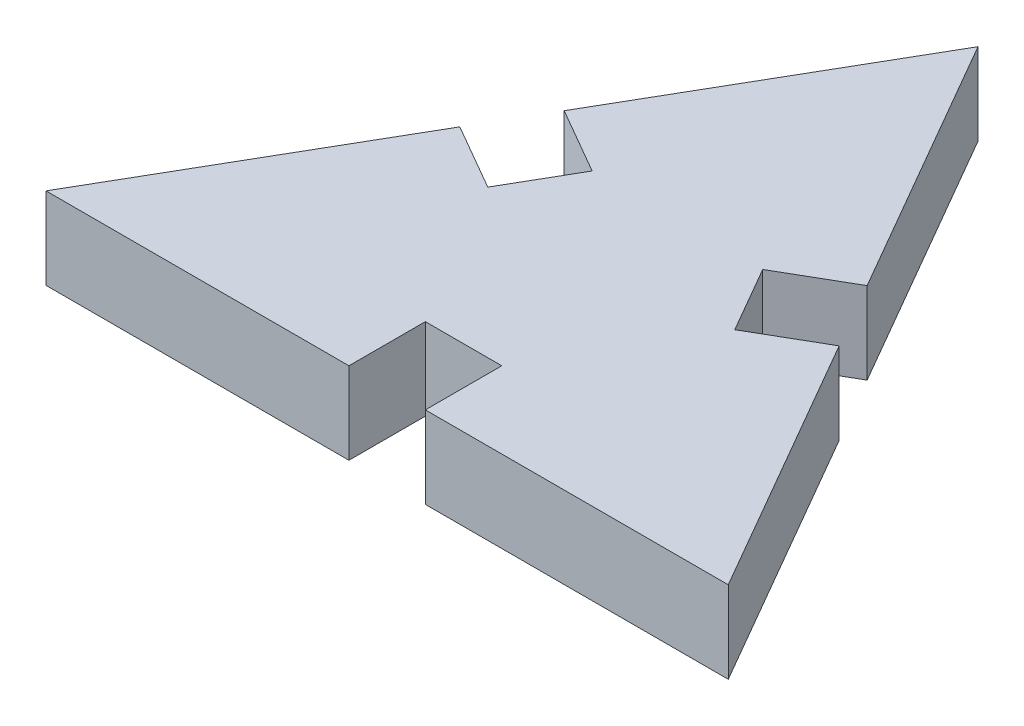
ISO-10303-21;
HEADER;
FILE_DESCRIPTION(('STEP AP214'),'2;1');
FILE_NAME('part.step','',(''),(''),'','','');
FILE_SCHEMA(('AUTOMOTIVE_DESIGN { 1 0 10303 214 1 1 1 1 }'));
ENDSEC;
DATA;
#1=APPLICATION_CONTEXT('core data for automotive mechanical design processes');
#2=APPLICATION_PROTOCOL_DEFINITION('international standard','automotive_design',2000,#1);
#3=PRODUCT_CONTEXT('',#1,'mechanical');
#4=PRODUCT('Part','Part','',(#3));
#5=PRODUCT_RELATED_PRODUCT_CATEGORY('part','',(#4));
#6=PRODUCT_DEFINITION_FORMATION('','',#4);
#7=PRODUCT_DEFINITION_CONTEXT('part definition',#1,'design');
#8=PRODUCT_DEFINITION('design','',#6,#7);
#9=PRODUCT_DEFINITION_SHAPE('','',#8);
#10=(LENGTH_UNIT() NAMED_UNIT(*) SI_UNIT(.MILLI.,.METRE.));
#11=(NAMED_UNIT(*) PLANE_ANGLE_UNIT() SI_UNIT($,.RADIAN.));
#12=(NAMED_UNIT(*) SI_UNIT($,.STERADIAN.) SOLID_ANGLE_UNIT());
#13=UNCERTAINTY_MEASURE_WITH_UNIT(LENGTH_MEASURE(1.E-05),#10,'distance_accuracy_value','');
#14=(GEOMETRIC_REPRESENTATION_CONTEXT(3) GLOBAL_UNCERTAINTY_ASSIGNED_CONTEXT((#13)) GLOBAL_UNIT_ASSIGNED_CONTEXT((#10,
#11,#12)) REPRESENTATION_CONTEXT('',''));
#15=CARTESIAN_POINT('',(0.,0.,0.));
#16=DIRECTION('',(0.,0.,1.));
#17=DIRECTION('',(1.,0.,0.));
#18=AXIS2_PLACEMENT_3D('',#15,#16,#17);
#19=CARTESIAN_POINT('',(12.5,3.,7.21687836487032));
#20=DIRECTION('',(-0.866025403784439,0.,0.5));
#21=DIRECTION('',(0.5,0.,0.866025403784439));
#22=AXIS2_PLACEMENT_3D('',#19,#20,#21);
#23=PLANE('',#22);
#24=DIRECTION('',(-0.5,0.,-0.866025403784439));
#25=VECTOR('',#24,1.);
#26=CARTESIAN_POINT('',(12.5,0.,7.21687836487032));
#27=LINE('',#26,#25);
#28=CARTESIAN_POINT('',(12.5,0.,7.21687836487032));
#29=VERTEX_POINT('',#28);
#30=CARTESIAN_POINT('',(6.95,0.,-2.39600361713695));
#31=VERTEX_POINT('',#30);
#32=EDGE_CURVE('E163',#29,#31,#27,.T.);
#33=ORIENTED_EDGE('',*,*,#32,.T.);
#34=DIRECTION('',(0.,1.,0.));
#35=VECTOR('',#34,1.);
#36=CARTESIAN_POINT('',(6.95,-0.00100000000000013,-2.39600361713695));
#37=LINE('',#36,#35);
#38=CARTESIAN_POINT('',(6.95,3.,-2.39600361713695));
#39=VERTEX_POINT('',#38);
#40=EDGE_CURVE('E150',#31,#39,#37,.T.);
#41=ORIENTED_EDGE('',*,*,#40,.T.);
#42=DIRECTION('',(-0.5,0.,-0.866025403784439));
#43=VECTOR('',#42,1.);
#44=CARTESIAN_POINT('',(12.5,3.,7.21687836487032));
#45=LINE('',#44,#43);
#46=CARTESIAN_POINT('',(12.5,3.,7.21687836487032));
#47=VERTEX_POINT('',#46);
#48=EDGE_CURVE('E240',#47,#39,#45,.T.);
#49=ORIENTED_EDGE('',*,*,#48,.F.);
#50=DIRECTION('',(0.,-1.,0.));
#51=VECTOR('',#50,1.);
#52=CARTESIAN_POINT('',(12.5,3.,7.21687836487032));
#53=LINE('',#52,#51);
#54=EDGE_CURVE('E176',#47,#29,#53,.T.);
#55=ORIENTED_EDGE('',*,*,#54,.T.);
#56=EDGE_LOOP('',(#33,#41,#49,#55));
#57=FACE_BOUND('',#56,.T.);
#58=ADVANCED_FACE('F34',(#57),#23,.F.);
#59=CARTESIAN_POINT('',(0.,3.,-14.4337567297406));
#60=DIRECTION('',(0.866025403784439,0.,0.5));
#61=DIRECTION('',(0.5,0.,-0.866025403784439));
#62=AXIS2_PLACEMENT_3D('',#59,#60,#61);
#63=PLANE('',#62);
#64=DIRECTION('',(-0.5,0.,0.866025403784439));
#65=VECTOR('',#64,1.);
#66=CARTESIAN_POINT('',(0.,0.,-14.4337567297406));
#67=LINE('',#66,#65);
#68=CARTESIAN_POINT('',(0.,0.,-14.4337567297406));
#69=VERTEX_POINT('',#68);
#70=CARTESIAN_POINT('',(-5.55000000000001,0.,-4.82087474773338));
#71=VERTEX_POINT('',#70);
#72=EDGE_CURVE('E162',#69,#71,#67,.T.);
#73=ORIENTED_EDGE('',*,*,#72,.T.);
#74=DIRECTION('',(0.,1.,0.));
#75=VECTOR('',#74,1.);
#76=CARTESIAN_POINT('',(-5.55000000000001,-0.00100000000000013,-4.82087474773338));
#77=LINE('',#76,#75);
#78=CARTESIAN_POINT('',(-5.55000000000001,3.,-4.82087474773338));
#79=VERTEX_POINT('',#78);
#80=EDGE_CURVE('E231',#71,#79,#77,.T.);
#81=ORIENTED_EDGE('',*,*,#80,.T.);
#82=DIRECTION('',(-0.5,0.,0.866025403784439));
#83=VECTOR('',#82,1.);
#84=CARTESIAN_POINT('',(0.,3.,-14.4337567297406));
#85=LINE('',#84,#83);
#86=CARTESIAN_POINT('',(0.,3.,-14.4337567297406));
#87=VERTEX_POINT('',#86);
#88=EDGE_CURVE('E243',#87,#79,#85,.T.);
#89=ORIENTED_EDGE('',*,*,#88,.F.);
#90=DIRECTION('',(0.,-1.,0.));
#91=VECTOR('',#90,1.);
#92=CARTESIAN_POINT('',(0.,3.,-14.4337567297406));
#93=LINE('',#92,#91);
#94=EDGE_CURVE('E11',#87,#69,#93,.T.);
#95=ORIENTED_EDGE('',*,*,#94,.T.);
#96=EDGE_LOOP('',(#73,#81,#89,#95));
#97=FACE_BOUND('',#96,.T.);
#98=ADVANCED_FACE('F265',(#97),#63,.F.);
#99=CARTESIAN_POINT('',(-12.5,3.,7.21687836487032));
#100=DIRECTION('',(0.,0.,-1.));
#101=DIRECTION('',(-1.,0.,0.));
#102=AXIS2_PLACEMENT_3D('',#99,#100,#101);
#103=PLANE('',#102);
#104=DIRECTION('',(1.,0.,0.));
#105=VECTOR('',#104,1.);
#106=CARTESIAN_POINT('',(-12.5,0.,7.21687836487032));
#107=LINE('',#106,#105);
#108=CARTESIAN_POINT('',(-12.5,0.,7.21687836487032));
#109=VERTEX_POINT('',#108);
#110=CARTESIAN_POINT('',(-1.39999999999999,0.,7.21687836487033));
#111=VERTEX_POINT('',#110);
#112=EDGE_CURVE('E173',#109,#111,#107,.T.);
#113=ORIENTED_EDGE('',*,*,#112,.T.);
#114=DIRECTION('',(0.,1.,0.));
#115=VECTOR('',#114,1.);
#116=CARTESIAN_POINT('',(-1.39999999999999,-0.00100000000000013,7.21687836487033));
#117=LINE('',#116,#115);
#118=CARTESIAN_POINT('',(-1.39999999999999,3.,7.21687836487033));
#119=VERTEX_POINT('',#118);
#120=EDGE_CURVE('E208',#111,#119,#117,.T.);
#121=ORIENTED_EDGE('',*,*,#120,.T.);
#122=DIRECTION('',(1.,0.,0.));
#123=VECTOR('',#122,1.);
#124=CARTESIAN_POINT('',(-12.5,3.,7.21687836487032));
#125=LINE('',#124,#123);
#126=CARTESIAN_POINT('',(-12.5,3.,7.21687836487032));
#127=VERTEX_POINT('',#126);
#128=EDGE_CURVE('E169',#127,#119,#125,.T.);
#129=ORIENTED_EDGE('',*,*,#128,.F.);
#130=DIRECTION('',(0.,-1.,0.));
#131=VECTOR('',#130,1.);
#132=CARTESIAN_POINT('',(-12.5,3.,7.21687836487032));
#133=LINE('',#132,#131);
#134=EDGE_CURVE('E42',#127,#109,#133,.T.);
#135=ORIENTED_EDGE('',*,*,#134,.T.);
#136=EDGE_LOOP('',(#113,#121,#129,#135));
#137=FACE_BOUND('',#136,.T.);
#138=ADVANCED_FACE('F183',(#137),#103,.F.);
#139=CARTESIAN_POINT('',(5.55,3.,-4.82087474773338));
#140=VERTEX_POINT('',#139);
#141=EDGE_CURVE('E156',#140,#87,#45,.T.);
#142=ORIENTED_EDGE('',*,*,#141,.F.);
#143=DIRECTION('',(0.,1.,0.));
#144=VECTOR('',#143,1.);
#145=CARTESIAN_POINT('',(5.55,-0.00100000000000013,-4.82087474773338));
#146=LINE('',#145,#144);
#147=CARTESIAN_POINT('',(5.55,0.,-4.82087474773338));
#148=VERTEX_POINT('',#147);
#149=EDGE_CURVE('E144',#148,#140,#146,.T.);
#150=ORIENTED_EDGE('',*,*,#149,.F.);
#151=EDGE_CURVE('E149',#148,#69,#27,.T.);
#152=ORIENTED_EDGE('',*,*,#151,.T.);
#153=ORIENTED_EDGE('',*,*,#94,.F.);
#154=EDGE_LOOP('',(#142,#150,#152,#153));
#155=FACE_BOUND('',#154,.T.);
#156=ADVANCED_FACE('F36',(#155),#23,.F.);
#157=CARTESIAN_POINT('',(-6.95000000000001,3.,-2.39600361713695));
#158=VERTEX_POINT('',#157);
#159=EDGE_CURVE('E242',#158,#127,#85,.T.);
#160=ORIENTED_EDGE('',*,*,#159,.F.);
#161=DIRECTION('',(0.,1.,0.));
#162=VECTOR('',#161,1.);
#163=CARTESIAN_POINT('',(-6.95000000000001,-0.00100000000000013,-2.39600361713695));
#164=LINE('',#163,#162);
#165=CARTESIAN_POINT('',(-6.95,0.,-2.39600361713695));
#166=VERTEX_POINT('',#165);
#167=EDGE_CURVE('E230',#166,#158,#164,.T.);
#168=ORIENTED_EDGE('',*,*,#167,.F.);
#169=EDGE_CURVE('E166',#166,#109,#67,.T.);
#170=ORIENTED_EDGE('',*,*,#169,.T.);
#171=ORIENTED_EDGE('',*,*,#134,.F.);
#172=EDGE_LOOP('',(#160,#168,#170,#171));
#173=FACE_BOUND('',#172,.T.);
#174=ADVANCED_FACE('F255',(#173),#63,.F.);
#175=CARTESIAN_POINT('',(1.40000000000001,3.,7.21687836487033));
#176=VERTEX_POINT('',#175);
#177=EDGE_CURVE('E245',#176,#47,#125,.T.);
#178=ORIENTED_EDGE('',*,*,#177,.F.);
#179=DIRECTION('',(0.,1.,0.));
#180=VECTOR('',#179,1.);
#181=CARTESIAN_POINT('',(1.40000000000001,-0.00100000000000013,7.21687836487033));
#182=LINE('',#181,#180);
#183=CARTESIAN_POINT('',(1.40000000000001,0.,7.21687836487032));
#184=VERTEX_POINT('',#183);
#185=EDGE_CURVE('E207',#184,#176,#182,.T.);
#186=ORIENTED_EDGE('',*,*,#185,.F.);
#187=EDGE_CURVE('E172',#184,#29,#107,.T.);
#188=ORIENTED_EDGE('',*,*,#187,.T.);
#189=ORIENTED_EDGE('',*,*,#54,.F.);
#190=EDGE_LOOP('',(#178,#186,#188,#189));
#191=FACE_BOUND('',#190,.T.);
#192=ADVANCED_FACE('F272',(#191),#103,.F.);
#193=CARTESIAN_POINT('',(0.,3.,0.));
#194=DIRECTION('',(0.,1.,0.));
#195=DIRECTION('',(0.,0.,1.));
#196=AXIS2_PLACEMENT_3D('',#193,#194,#195);
#197=PLANE('',#196);
#198=DIRECTION('',(0.866025403784439,0.,-0.5));
#199=VECTOR('',#198,1.);
#200=CARTESIAN_POINT('',(6.95,3.,-2.39600361713695));
#201=LINE('',#200,#199);
#202=CARTESIAN_POINT('',(4.52512886940358,3.,-0.996003617136954));
#203=VERTEX_POINT('',#202);
#204=EDGE_CURVE('E157',#203,#39,#201,.T.);
#205=ORIENTED_EDGE('',*,*,#204,.F.);
#206=DIRECTION('',(0.5,0.,0.866025403784438));
#207=VECTOR('',#206,1.);
#208=CARTESIAN_POINT('',(3.12512886940358,3.,-3.42087474773338));
#209=LINE('',#208,#207);
#210=CARTESIAN_POINT('',(3.12512886940358,3.,-3.42087474773338));
#211=VERTEX_POINT('',#210);
#212=EDGE_CURVE('E450',#211,#203,#209,.T.);
#213=ORIENTED_EDGE('',*,*,#212,.F.);
#214=DIRECTION('',(-0.866025403784438,0.,0.5));
#215=VECTOR('',#214,1.);
#216=CARTESIAN_POINT('',(5.55,3.,-4.82087474773338));
#217=LINE('',#216,#215);
#218=EDGE_CURVE('E452',#140,#211,#217,.T.);
#219=ORIENTED_EDGE('',*,*,#218,.F.);
#220=ORIENTED_EDGE('',*,*,#141,.T.);
#221=ORIENTED_EDGE('',*,*,#88,.T.);
#222=DIRECTION('',(-0.866025403784438,0.,-0.5));
#223=VECTOR('',#222,1.);
#224=CARTESIAN_POINT('',(-5.55000000000001,3.,-4.82087474773338));
#225=LINE('',#224,#223);
#226=CARTESIAN_POINT('',(-3.12512886940358,3.,-3.42087474773338));
#227=VERTEX_POINT('',#226);
#228=EDGE_CURVE('E228',#227,#79,#225,.T.);
#229=ORIENTED_EDGE('',*,*,#228,.F.);
#230=DIRECTION('',(0.5,0.,-0.866025403784439));
#231=VECTOR('',#230,1.);
#232=CARTESIAN_POINT('',(-4.52512886940358,3.,-0.996003617136948));
#233=LINE('',#232,#231);
#234=CARTESIAN_POINT('',(-4.52512886940358,3.,-0.996003617136948));
#235=VERTEX_POINT('',#234);
#236=EDGE_CURVE('E225',#235,#227,#233,.T.);
#237=ORIENTED_EDGE('',*,*,#236,.F.);
#238=DIRECTION('',(0.866025403784439,0.,0.5));
#239=VECTOR('',#238,1.);
#240=CARTESIAN_POINT('',(-6.95000000000001,3.,-2.39600361713695));
#241=LINE('',#240,#239);
#242=EDGE_CURVE('E222',#158,#235,#241,.T.);
#243=ORIENTED_EDGE('',*,*,#242,.F.);
#244=ORIENTED_EDGE('',*,*,#159,.T.);
#245=ORIENTED_EDGE('',*,*,#128,.T.);
#246=DIRECTION('',(0.,0.,1.));
#247=VECTOR('',#246,1.);
#248=CARTESIAN_POINT('',(-1.39999999999999,3.,7.21687836487033));
#249=LINE('',#248,#247);
#250=CARTESIAN_POINT('',(-1.39999999999999,3.,4.41687836487033));
#251=VERTEX_POINT('',#250);
#252=EDGE_CURVE('E205',#251,#119,#249,.T.);
#253=ORIENTED_EDGE('',*,*,#252,.F.);
#254=DIRECTION('',(-1.,0.,0.));
#255=VECTOR('',#254,1.);
#256=CARTESIAN_POINT('',(1.4,3.,4.41687836487033));
#257=LINE('',#256,#255);
#258=CARTESIAN_POINT('',(1.4,3.,4.41687836487033));
#259=VERTEX_POINT('',#258);
#260=EDGE_CURVE('E198',#259,#251,#257,.T.);
#261=ORIENTED_EDGE('',*,*,#260,.F.);
#262=DIRECTION('',(0.,0.,-1.));
#263=VECTOR('',#262,1.);
#264=CARTESIAN_POINT('',(1.40000000000001,3.,7.21687836487033));
#265=LINE('',#264,#263);
#266=EDGE_CURVE('E195',#176,#259,#265,.T.);
#267=ORIENTED_EDGE('',*,*,#266,.F.);
#268=ORIENTED_EDGE('',*,*,#177,.T.);
#269=ORIENTED_EDGE('',*,*,#48,.T.);
#270=EDGE_LOOP('',(#205,#213,#219,#220,#221,#229,#237,#243,#244,#245,#253,#261,#267,#268,#269));
#271=FACE_BOUND('',#270,.T.);
#272=ADVANCED_FACE('F251',(#271),#197,.T.);
#273=CARTESIAN_POINT('',(0.,0.,0.));
#274=DIRECTION('',(0.,1.,0.));
#275=DIRECTION('',(0.,0.,1.));
#276=AXIS2_PLACEMENT_3D('',#273,#274,#275);
#277=PLANE('',#276);
#278=DIRECTION('',(-0.5,0.,-0.866025403784439));
#279=VECTOR('',#278,1.);
#280=CARTESIAN_POINT('',(3.12512886940358,0.,-3.42087474773338));
#281=LINE('',#280,#279);
#282=CARTESIAN_POINT('',(4.52512886940358,0.,-0.996003617136954));
#283=VERTEX_POINT('',#282);
#284=CARTESIAN_POINT('',(3.12512886940358,0.,-3.42087474773338));
#285=VERTEX_POINT('',#284);
#286=EDGE_CURVE('E49',#283,#285,#281,.T.);
#287=ORIENTED_EDGE('',*,*,#286,.F.);
#288=DIRECTION('',(-0.866025403784439,0.,0.5));
#289=VECTOR('',#288,1.);
#290=CARTESIAN_POINT('',(6.95,0.,-2.39600361713695));
#291=LINE('',#290,#289);
#292=EDGE_CURVE('E444',#31,#283,#291,.T.);
#293=ORIENTED_EDGE('',*,*,#292,.F.);
#294=ORIENTED_EDGE('',*,*,#32,.F.);
#295=ORIENTED_EDGE('',*,*,#187,.F.);
#296=DIRECTION('',(0.,0.,1.));
#297=VECTOR('',#296,1.);
#298=CARTESIAN_POINT('',(1.40000000000001,0.,7.21687836487033));
#299=LINE('',#298,#297);
#300=CARTESIAN_POINT('',(1.4,0.,4.41687836487033));
#301=VERTEX_POINT('',#300);
#302=EDGE_CURVE('E210',#301,#184,#299,.T.);
#303=ORIENTED_EDGE('',*,*,#302,.F.);
#304=DIRECTION('',(1.,0.,0.));
#305=VECTOR('',#304,1.);
#306=CARTESIAN_POINT('',(1.4,0.,4.41687836487033));
#307=LINE('',#306,#305);
#308=CARTESIAN_POINT('',(-1.39999999999999,0.,4.41687836487033));
#309=VERTEX_POINT('',#308);
#310=EDGE_CURVE('E57',#309,#301,#307,.T.);
#311=ORIENTED_EDGE('',*,*,#310,.F.);
#312=DIRECTION('',(0.,0.,-1.));
#313=VECTOR('',#312,1.);
#314=CARTESIAN_POINT('',(-1.39999999999999,0.,7.21687836487033));
#315=LINE('',#314,#313);
#316=EDGE_CURVE('E192',#111,#309,#315,.T.);
#317=ORIENTED_EDGE('',*,*,#316,.F.);
#318=ORIENTED_EDGE('',*,*,#112,.F.);
#319=ORIENTED_EDGE('',*,*,#169,.F.);
#320=DIRECTION('',(-0.866025403784439,0.,-0.5));
#321=VECTOR('',#320,1.);
#322=CARTESIAN_POINT('',(-6.95000000000001,0.,-2.39600361713695));
#323=LINE('',#322,#321);
#324=CARTESIAN_POINT('',(-4.52512886940358,0.,-0.996003617136948));
#325=VERTEX_POINT('',#324);
#326=EDGE_CURVE('E200',#325,#166,#323,.T.);
#327=ORIENTED_EDGE('',*,*,#326,.F.);
#328=DIRECTION('',(-0.5,0.,0.866025403784439));
#329=VECTOR('',#328,1.);
#330=CARTESIAN_POINT('',(-4.52512886940358,0.,-0.996003617136948));
#331=LINE('',#330,#329);
#332=CARTESIAN_POINT('',(-3.12512886940358,0.,-3.42087474773338));
#333=VERTEX_POINT('',#332);
#334=EDGE_CURVE('E217',#333,#325,#331,.T.);
#335=ORIENTED_EDGE('',*,*,#334,.F.);
#336=DIRECTION('',(0.866025403784439,0.,0.5));
#337=VECTOR('',#336,1.);
#338=CARTESIAN_POINT('',(-5.55000000000001,0.,-4.82087474773338));
#339=LINE('',#338,#337);
#340=EDGE_CURVE('E219',#71,#333,#339,.T.);
#341=ORIENTED_EDGE('',*,*,#340,.F.);
#342=ORIENTED_EDGE('',*,*,#72,.F.);
#343=ORIENTED_EDGE('',*,*,#151,.F.);
#344=DIRECTION('',(0.866025403784439,0.,-0.5));
#345=VECTOR('',#344,1.);
#346=CARTESIAN_POINT('',(5.55,0.,-4.82087474773338));
#347=LINE('',#346,#345);
#348=EDGE_CURVE('E140',#285,#148,#347,.T.);
#349=ORIENTED_EDGE('',*,*,#348,.F.);
#350=EDGE_LOOP('',(#287,#293,#294,#295,#303,#311,#317,#318,#319,#327,#335,#341,#342,#343,#349));
#351=FACE_BOUND('',#350,.T.);
#352=ADVANCED_FACE('F159',(#351),#277,.F.);
#353=CARTESIAN_POINT('',(-5.55000000000001,-0.00100000000000013,-4.82087474773338));
#354=DIRECTION('',(0.5,0.,-0.866025403784438));
#355=DIRECTION('',(-0.866025403784439,0.,-0.5));
#356=AXIS2_PLACEMENT_3D('',#353,#354,#355);
#357=PLANE('',#356);
#358=ORIENTED_EDGE('',*,*,#340,.T.);
#359=DIRECTION('',(0.,1.,0.));
#360=VECTOR('',#359,1.);
#361=CARTESIAN_POINT('',(-3.12512886940358,-0.00100000000000013,-3.42087474773338));
#362=LINE('',#361,#360);
#363=EDGE_CURVE('E234',#333,#227,#362,.T.);
#364=ORIENTED_EDGE('',*,*,#363,.T.);
#365=ORIENTED_EDGE('',*,*,#228,.T.);
#366=ORIENTED_EDGE('',*,*,#80,.F.);
#367=EDGE_LOOP('',(#358,#364,#365,#366));
#368=FACE_BOUND('',#367,.T.);
#369=ADVANCED_FACE('F263',(#368),#357,.F.);
#370=CARTESIAN_POINT('',(-4.52512886940358,-0.00100000000000013,-0.996003617136948));
#371=DIRECTION('',(0.866025403784439,0.,0.5));
#372=DIRECTION('',(0.5,0.,-0.866025403784439));
#373=AXIS2_PLACEMENT_3D('',#370,#371,#372);
#374=PLANE('',#373);
#375=ORIENTED_EDGE('',*,*,#334,.T.);
#376=DIRECTION('',(0.,1.,0.));
#377=VECTOR('',#376,1.);
#378=CARTESIAN_POINT('',(-4.52512886940358,-0.00100000000000013,-0.996003617136948));
#379=LINE('',#378,#377);
#380=EDGE_CURVE('E236',#325,#235,#379,.T.);
#381=ORIENTED_EDGE('',*,*,#380,.T.);
#382=ORIENTED_EDGE('',*,*,#236,.T.);
#383=ORIENTED_EDGE('',*,*,#363,.F.);
#384=EDGE_LOOP('',(#375,#381,#382,#383));
#385=FACE_BOUND('',#384,.T.);
#386=ADVANCED_FACE('F261',(#385),#374,.F.);
#387=CARTESIAN_POINT('',(-6.95000000000001,-0.00100000000000013,-2.39600361713695));
#388=DIRECTION('',(-0.5,0.,0.866025403784439));
#389=DIRECTION('',(0.866025403784439,0.,0.5));
#390=AXIS2_PLACEMENT_3D('',#387,#388,#389);
#391=PLANE('',#390);
#392=ORIENTED_EDGE('',*,*,#326,.T.);
#393=ORIENTED_EDGE('',*,*,#167,.T.);
#394=ORIENTED_EDGE('',*,*,#242,.T.);
#395=ORIENTED_EDGE('',*,*,#380,.F.);
#396=EDGE_LOOP('',(#392,#393,#394,#395));
#397=FACE_BOUND('',#396,.T.);
#398=ADVANCED_FACE('F257',(#397),#391,.F.);
#399=CARTESIAN_POINT('',(-1.39999999999999,-0.00100000000000013,7.21687836487033));
#400=DIRECTION('',(-1.,0.,0.));
#401=DIRECTION('',(0.,0.,1.));
#402=AXIS2_PLACEMENT_3D('',#399,#400,#401);
#403=PLANE('',#402);
#404=ORIENTED_EDGE('',*,*,#316,.T.);
#405=DIRECTION('',(0.,1.,0.));
#406=VECTOR('',#405,1.);
#407=CARTESIAN_POINT('',(-1.39999999999999,-0.00100000000000013,4.41687836487033));
#408=LINE('',#407,#406);
#409=EDGE_CURVE('E211',#309,#251,#408,.T.);
#410=ORIENTED_EDGE('',*,*,#409,.T.);
#411=ORIENTED_EDGE('',*,*,#252,.T.);
#412=ORIENTED_EDGE('',*,*,#120,.F.);
#413=EDGE_LOOP('',(#404,#410,#411,#412));
#414=FACE_BOUND('',#413,.T.);
#415=ADVANCED_FACE('F317',(#414),#403,.F.);
#416=CARTESIAN_POINT('',(1.4,-0.00100000000000013,4.41687836487033));
#417=DIRECTION('',(0.,0.,-1.));
#418=DIRECTION('',(-1.,0.,0.));
#419=AXIS2_PLACEMENT_3D('',#416,#417,#418);
#420=PLANE('',#419);
#421=ORIENTED_EDGE('',*,*,#310,.T.);
#422=DIRECTION('',(0.,1.,0.));
#423=VECTOR('',#422,1.);
#424=CARTESIAN_POINT('',(1.4,-0.00100000000000013,4.41687836487033));
#425=LINE('',#424,#423);
#426=EDGE_CURVE('E213',#301,#259,#425,.T.);
#427=ORIENTED_EDGE('',*,*,#426,.T.);
#428=ORIENTED_EDGE('',*,*,#260,.T.);
#429=ORIENTED_EDGE('',*,*,#409,.F.);
#430=EDGE_LOOP('',(#421,#427,#428,#429));
#431=FACE_BOUND('',#430,.T.);
#432=ADVANCED_FACE('F360',(#431),#420,.F.);
#433=CARTESIAN_POINT('',(1.40000000000001,-0.00100000000000013,7.21687836487033));
#434=DIRECTION('',(1.,0.,0.));
#435=DIRECTION('',(0.,0.,-1.));
#436=AXIS2_PLACEMENT_3D('',#433,#434,#435);
#437=PLANE('',#436);
#438=ORIENTED_EDGE('',*,*,#302,.T.);
#439=ORIENTED_EDGE('',*,*,#185,.T.);
#440=ORIENTED_EDGE('',*,*,#266,.T.);
#441=ORIENTED_EDGE('',*,*,#426,.F.);
#442=EDGE_LOOP('',(#438,#439,#440,#441));
#443=FACE_BOUND('',#442,.T.);
#444=ADVANCED_FACE('F350',(#443),#437,.F.);
#445=CARTESIAN_POINT('',(6.95,-0.00100000000000013,-2.39600361713695));
#446=DIRECTION('',(0.5,0.,0.866025403784438));
#447=DIRECTION('',(0.866025403784439,0.,-0.5));
#448=AXIS2_PLACEMENT_3D('',#445,#446,#447);
#449=PLANE('',#448);
#450=ORIENTED_EDGE('',*,*,#292,.T.);
#451=DIRECTION('',(0.,1.,0.));
#452=VECTOR('',#451,1.);
#453=CARTESIAN_POINT('',(4.52512886940358,-0.00100000000000013,-0.996003617136954));
#454=LINE('',#453,#452);
#455=EDGE_CURVE('E457',#283,#203,#454,.T.);
#456=ORIENTED_EDGE('',*,*,#455,.T.);
#457=ORIENTED_EDGE('',*,*,#204,.T.);
#458=ORIENTED_EDGE('',*,*,#40,.F.);
#459=EDGE_LOOP('',(#450,#456,#457,#458));
#460=FACE_BOUND('',#459,.T.);
#461=ADVANCED_FACE('F341',(#460),#449,.F.);
#462=CARTESIAN_POINT('',(3.12512886940358,-0.00100000000000013,-3.42087474773338));
#463=DIRECTION('',(-0.866025403784438,0.,0.5));
#464=DIRECTION('',(0.5,0.,0.866025403784439));
#465=AXIS2_PLACEMENT_3D('',#462,#463,#464);
#466=PLANE('',#465);
#467=ORIENTED_EDGE('',*,*,#286,.T.);
#468=DIRECTION('',(0.,1.,0.));
#469=VECTOR('',#468,1.);
#470=CARTESIAN_POINT('',(3.12512886940358,-0.00100000000000013,-3.42087474773338));
#471=LINE('',#470,#469);
#472=EDGE_CURVE('E146',#285,#211,#471,.T.);
#473=ORIENTED_EDGE('',*,*,#472,.T.);
#474=ORIENTED_EDGE('',*,*,#212,.T.);
#475=ORIENTED_EDGE('',*,*,#455,.F.);
#476=EDGE_LOOP('',(#467,#473,#474,#475));
#477=FACE_BOUND('',#476,.T.);
#478=ADVANCED_FACE('F332',(#477),#466,.F.);
#479=CARTESIAN_POINT('',(5.55,-0.00100000000000013,-4.82087474773338));
#480=DIRECTION('',(-0.5,0.,-0.866025403784438));
#481=DIRECTION('',(-0.866025403784439,0.,0.5));
#482=AXIS2_PLACEMENT_3D('',#479,#480,#481);
#483=PLANE('',#482);
#484=ORIENTED_EDGE('',*,*,#348,.T.);
#485=ORIENTED_EDGE('',*,*,#149,.T.);
#486=ORIENTED_EDGE('',*,*,#218,.T.);
#487=ORIENTED_EDGE('',*,*,#472,.F.);
#488=EDGE_LOOP('',(#484,#485,#486,#487));
#489=FACE_BOUND('',#488,.T.);
#490=ADVANCED_FACE('F142',(#489),#483,.F.);
#491=CLOSED_SHELL('',(#58,#98,#138,#156,#174,#192,#272,#352,#369,#386,#398,#415,#432,#444,#461,
#478,#490));
#492=MANIFOLD_SOLID_BREP('B2',#491);
#493=ADVANCED_BREP_SHAPE_REPRESENTATION('',(#18,#492),#14);
#494=SHAPE_DEFINITION_REPRESENTATION(#9,#493);
ENDSEC;
END-ISO-10303-21;
